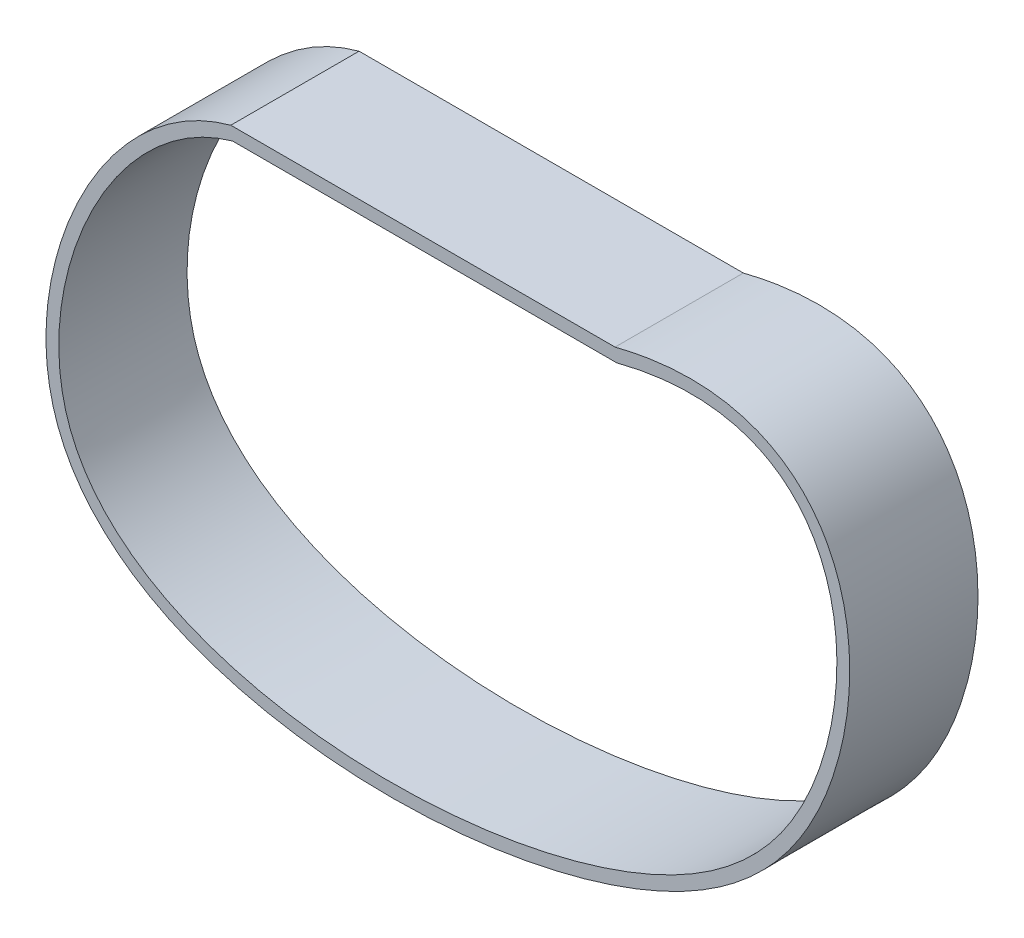
ISO-10303-21;
HEADER;
FILE_DESCRIPTION(('STEP AP214'),'2;1');
FILE_NAME('part.step','',(''),(''),'','','');
FILE_SCHEMA(('AUTOMOTIVE_DESIGN { 1 0 10303 214 1 1 1 1 }'));
ENDSEC;
DATA;
#1=APPLICATION_CONTEXT('core data for automotive mechanical design processes');
#2=APPLICATION_PROTOCOL_DEFINITION('international standard','automotive_design',2000,#1);
#3=PRODUCT_CONTEXT('',#1,'mechanical');
#4=PRODUCT('Part','Part','',(#3));
#5=PRODUCT_RELATED_PRODUCT_CATEGORY('part','',(#4));
#6=PRODUCT_DEFINITION_FORMATION('','',#4);
#7=PRODUCT_DEFINITION_CONTEXT('part definition',#1,'design');
#8=PRODUCT_DEFINITION('design','',#6,#7);
#9=PRODUCT_DEFINITION_SHAPE('','',#8);
#10=(LENGTH_UNIT() NAMED_UNIT(*) SI_UNIT(.MILLI.,.METRE.));
#11=(NAMED_UNIT(*) PLANE_ANGLE_UNIT() SI_UNIT($,.RADIAN.));
#12=(NAMED_UNIT(*) SI_UNIT($,.STERADIAN.) SOLID_ANGLE_UNIT());
#13=UNCERTAINTY_MEASURE_WITH_UNIT(LENGTH_MEASURE(1.E-05),#10,'distance_accuracy_value','');
#14=(GEOMETRIC_REPRESENTATION_CONTEXT(3) GLOBAL_UNCERTAINTY_ASSIGNED_CONTEXT((#13)) GLOBAL_UNIT_ASSIGNED_CONTEXT((#10,
#11,#12)) REPRESENTATION_CONTEXT('',''));
#15=CARTESIAN_POINT('',(0.,0.,0.));
#16=DIRECTION('',(0.,0.,1.));
#17=DIRECTION('',(1.,0.,0.));
#18=AXIS2_PLACEMENT_3D('',#15,#16,#17);
#19=CARTESIAN_POINT('',(7.04176794798978,-75.7034672830424,10.));
#20=DIRECTION('',(0.,0.,1.));
#21=DIRECTION('',(1.,0.,0.));
#22=AXIS2_PLACEMENT_3D('',#19,#20,#21);
#23=PLANE('',#22);
#24=CARTESIAN_POINT('',(-29.1094889381039,2.,10.));
#25=CARTESIAN_POINT('',(-29.2711666058595,1.9549326911528,10.));
#26=CARTESIAN_POINT('',(-29.5884364179434,1.86739098593829,10.));
#27=CARTESIAN_POINT('',(-30.2695314803509,1.6639563012079,10.));
#28=CARTESIAN_POINT('',(-31.4262311370426,1.28138083290379,10.));
#29=CARTESIAN_POINT('',(-33.7085773620182,0.380367449981853,10.));
#30=CARTESIAN_POINT('',(-38.0592019083928,-1.90982717441847,10.));
#31=CARTESIAN_POINT('',(-45.8904529427792,-8.21343610271494,10.));
#32=CARTESIAN_POINT('',(-52.6174472990949,-18.3270178560385,10.));
#33=CARTESIAN_POINT('',(-56.6236890520603,-29.5702665896402,10.));
#34=CARTESIAN_POINT('',(-58.101014880325,-38.1472034200514,10.));
#35=CARTESIAN_POINT('',(-57.8848929333308,-46.4553824854731,10.));
#36=CARTESIAN_POINT('',(-55.6832624950651,-54.0634661457601,10.));
#37=CARTESIAN_POINT('',(-51.496493039097,-60.4689673944458,10.));
#38=CARTESIAN_POINT('',(-43.8079720882923,-67.4320437479037,10.));
#39=CARTESIAN_POINT('',(-31.0172297044914,-73.3299705086028,10.));
#40=CARTESIAN_POINT('',(-12.5712535388374,-76.531233105732,10.));
#41=CARTESIAN_POINT('',(7.14083142473348,-76.2381425853265,10.));
#42=CARTESIAN_POINT('',(23.0722515106572,-73.3205239735684,10.));
#43=CARTESIAN_POINT('',(34.5691892012262,-69.5137189143569,10.));
#44=CARTESIAN_POINT('',(42.3972992010869,-65.8979102287756,10.));
#45=CARTESIAN_POINT('',(49.3729385138688,-61.3851431325316,10.));
#46=CARTESIAN_POINT('',(55.3956407749545,-55.8640534739069,10.));
#47=CARTESIAN_POINT('',(60.3600624453533,-49.2464626961319,10.));
#48=CARTESIAN_POINT('',(64.1625243454797,-41.4488946063427,10.));
#49=CARTESIAN_POINT('',(66.6524342232584,-32.9502772539975,10.));
#50=CARTESIAN_POINT('',(67.6683439176188,-24.2382306175426,10.));
#51=CARTESIAN_POINT('',(67.0127506533382,-15.7897180697165,10.));
#52=CARTESIAN_POINT('',(64.4422975211589,-8.0867291551945,10.));
#53=CARTESIAN_POINT('',(60.4443345047106,-2.76390479899914,10.));
#54=CARTESIAN_POINT('',(56.0440354852006,0.455274825771143,10.));
#55=CARTESIAN_POINT('',(52.1573597719881,2.25628821612541,10.));
#56=CARTESIAN_POINT('',(47.700836796645,3.37394475818058,10.));
#57=CARTESIAN_POINT('',(43.519128896257,3.69373851539056,10.));
#58=CARTESIAN_POINT('',(39.8875333080928,3.56063997570251,10.));
#59=CARTESIAN_POINT('',(37.01944760836,3.26100487102238,10.));
#60=CARTESIAN_POINT('',(34.5020235457053,2.83865803088808,10.));
#61=CARTESIAN_POINT('',(32.4202856585923,2.39664087013776,10.));
#62=CARTESIAN_POINT('',(31.3390053913286,2.13589874043388,10.));
#63=CARTESIAN_POINT('',(30.8060193736147,2.,10.));
#64=B_SPLINE_CURVE_WITH_KNOTS('',3,(#24,#25,#26,#27,#28,#29,#30,#31,#32,#33,#34,#35,#36,#37,#38,
#39,#40,#41,#42,#43,#44,#45,#46,#47,#48,#49,#50,#51,#52,#53,#54,#55,#56,#57,#58,#59,#60,#61,#62,
#63),.UNSPECIFIED.,.F.,.F.,(4,1,1,1,1,1,1,1,1,1,1,1,1,1,1,1,1,1,1,1,1,1,1,1,1,1,1,1,1,1,1,1,1,1,
1,1,1,4),(0.000597944691064563,0.00255204829505629,0.00450615189904802,0.00841435910703148,
0.0162307735229985,0.0318636023549325,0.0631292600188003,0.125660575346536,0.156926233010404,
0.188191890674272,0.219457548338139,0.250723206002007,0.281988863665875,0.313254521329743,
0.375785836657479,0.438317151985215,0.50084846731295,0.563379782640686,0.594645440304554,
0.625911097968422,0.65717675563229,0.688442413296158,0.719708070960025,0.750973728623893,
0.782239386287761,0.813505043951629,0.844770701615497,0.876036359279365,0.907302016943233,
0.922934845775166,0.9385676746071,0.954200503439034,0.969833332270968,0.977649746686935,
0.985466161102902,0.993282575518869,0.997190782726853,1.00109898993484),.UNSPECIFIED.);
#65=CARTESIAN_POINT('',(-29.1094889381039,2.,10.));
#66=VERTEX_POINT('',#65);
#67=CARTESIAN_POINT('',(30.8060193736147,2.,10.));
#68=VERTEX_POINT('',#67);
#69=EDGE_CURVE('E118',#66,#68,#64,.T.);
#70=ORIENTED_EDGE('',*,*,#69,.T.);
#71=DIRECTION('',(-1.,0.,0.));
#72=VECTOR('',#71,1.);
#73=CARTESIAN_POINT('',(-29.1094889381039,2.,10.));
#74=LINE('',#73,#72);
#75=EDGE_CURVE('E122',#68,#66,#74,.T.);
#76=ORIENTED_EDGE('',*,*,#75,.T.);
#77=EDGE_LOOP('',(#70,#76));
#78=FACE_BOUND('',#77,.T.);
#79=DIRECTION('',(-1.,0.,0.));
#80=VECTOR('',#79,1.);
#81=CARTESIAN_POINT('',(-28.8359550805237,0.,10.));
#82=LINE('',#81,#80);
#83=CARTESIAN_POINT('',(31.0589792051905,0.,10.));
#84=VERTEX_POINT('',#83);
#85=CARTESIAN_POINT('',(-28.8359550805237,0.,10.));
#86=VERTEX_POINT('',#85);
#87=EDGE_CURVE('E74',#84,#86,#82,.T.);
#88=ORIENTED_EDGE('',*,*,#87,.F.);
#89=CARTESIAN_POINT('',(-28.8359550805237,0.,10.));
#90=CARTESIAN_POINT('',(-47.7084642048188,-5.26067210909981,10.));
#91=CARTESIAN_POINT('',(-78.4238630547212,-73.4294227613478,10.));
#92=CARTESIAN_POINT('',(19.3538091058708,-80.6919886023268,10.));
#93=CARTESIAN_POINT('',(72.2254747069718,-44.3020234312468,10.));
#94=CARTESIAN_POINT('',(68.4954839154176,9.70336515848219,10.));
#95=CARTESIAN_POINT('',(31.0589792051905,0.,10.));
#96=B_SPLINE_CURVE_WITH_KNOTS('',3,(#89,#90,#91,#92,#93,#94,#95),.UNSPECIFIED.,.F.,.F.,(4,1,1,1,
4),(0.,0.236147059818953,0.582786677606789,0.722119225745826,1.),.UNSPECIFIED.);
#97=EDGE_CURVE('E80',#86,#84,#96,.T.);
#98=ORIENTED_EDGE('',*,*,#97,.F.);
#99=EDGE_LOOP('',(#88,#98));
#100=FACE_BOUND('',#99,.T.);
#101=ADVANCED_FACE('F33',(#78,#100),#23,.T.);
#102=CARTESIAN_POINT('',(7.04176794798978,-75.7034672830424,-10.));
#103=DIRECTION('',(0.,0.,1.));
#104=DIRECTION('',(1.,0.,0.));
#105=AXIS2_PLACEMENT_3D('',#102,#103,#104);
#106=PLANE('',#105);
#107=CARTESIAN_POINT('',(-29.1094889381039,2.,-10.));
#108=CARTESIAN_POINT('',(-29.2711666058595,1.9549326911528,-10.));
#109=CARTESIAN_POINT('',(-29.5884364179434,1.86739098593829,-10.));
#110=CARTESIAN_POINT('',(-30.2695314803509,1.6639563012079,-10.));
#111=CARTESIAN_POINT('',(-31.4262311370426,1.28138083290379,-10.));
#112=CARTESIAN_POINT('',(-33.7085773620182,0.380367449981853,-10.));
#113=CARTESIAN_POINT('',(-38.0592019083928,-1.90982717441847,-10.));
#114=CARTESIAN_POINT('',(-45.8904529427792,-8.21343610271494,-10.));
#115=CARTESIAN_POINT('',(-52.6174472990949,-18.3270178560385,-10.));
#116=CARTESIAN_POINT('',(-56.6236890520603,-29.5702665896402,-10.));
#117=CARTESIAN_POINT('',(-58.101014880325,-38.1472034200514,-10.));
#118=CARTESIAN_POINT('',(-57.8848929333308,-46.4553824854731,-10.));
#119=CARTESIAN_POINT('',(-55.6832624950651,-54.0634661457601,-10.));
#120=CARTESIAN_POINT('',(-51.496493039097,-60.4689673944458,-10.));
#121=CARTESIAN_POINT('',(-43.8079720882923,-67.4320437479037,-10.));
#122=CARTESIAN_POINT('',(-31.0172297044914,-73.3299705086028,-10.));
#123=CARTESIAN_POINT('',(-12.5712535388374,-76.531233105732,-10.));
#124=CARTESIAN_POINT('',(7.14083142473348,-76.2381425853265,-10.));
#125=CARTESIAN_POINT('',(23.0722515106572,-73.3205239735684,-10.));
#126=CARTESIAN_POINT('',(34.5691892012262,-69.5137189143569,-10.));
#127=CARTESIAN_POINT('',(42.3972992010869,-65.8979102287756,-10.));
#128=CARTESIAN_POINT('',(49.3729385138688,-61.3851431325316,-10.));
#129=CARTESIAN_POINT('',(55.3956407749545,-55.8640534739069,-10.));
#130=CARTESIAN_POINT('',(60.3600624453533,-49.2464626961319,-10.));
#131=CARTESIAN_POINT('',(64.1625243454797,-41.4488946063427,-10.));
#132=CARTESIAN_POINT('',(66.6524342232584,-32.9502772539975,-10.));
#133=CARTESIAN_POINT('',(67.6683439176188,-24.2382306175426,-10.));
#134=CARTESIAN_POINT('',(67.0127506533382,-15.7897180697165,-10.));
#135=CARTESIAN_POINT('',(64.4422975211589,-8.0867291551945,-10.));
#136=CARTESIAN_POINT('',(60.4443345047106,-2.76390479899914,-10.));
#137=CARTESIAN_POINT('',(56.0440354852006,0.455274825771143,-10.));
#138=CARTESIAN_POINT('',(52.1573597719881,2.25628821612541,-10.));
#139=CARTESIAN_POINT('',(47.700836796645,3.37394475818058,-10.));
#140=CARTESIAN_POINT('',(43.519128896257,3.69373851539056,-10.));
#141=CARTESIAN_POINT('',(39.8875333080928,3.56063997570251,-10.));
#142=CARTESIAN_POINT('',(37.01944760836,3.26100487102238,-10.));
#143=CARTESIAN_POINT('',(34.5020235457053,2.83865803088808,-10.));
#144=CARTESIAN_POINT('',(32.4202856585923,2.39664087013776,-10.));
#145=CARTESIAN_POINT('',(31.3390053913286,2.13589874043388,-10.));
#146=CARTESIAN_POINT('',(30.8060193736147,2.,-10.));
#147=B_SPLINE_CURVE_WITH_KNOTS('',3,(#107,#108,#109,#110,#111,#112,#113,#114,#115,#116,#117,
#118,#119,#120,#121,#122,#123,#124,#125,#126,#127,#128,#129,#130,#131,#132,#133,#134,#135,#136,
#137,#138,#139,#140,#141,#142,#143,#144,#145,#146),.UNSPECIFIED.,.F.,.F.,(4,1,1,1,1,1,1,1,1,1,1,
1,1,1,1,1,1,1,1,1,1,1,1,1,1,1,1,1,1,1,1,1,1,1,1,1,1,4),(0.000597944691064563,
0.00255204829505629,0.00450615189904802,0.00841435910703148,0.0162307735229985,
0.0318636023549325,0.0631292600188003,0.125660575346536,0.156926233010404,0.188191890674272,
0.219457548338139,0.250723206002007,0.281988863665875,0.313254521329743,0.375785836657479,
0.438317151985215,0.50084846731295,0.563379782640686,0.594645440304554,0.625911097968422,
0.65717675563229,0.688442413296158,0.719708070960025,0.750973728623893,0.782239386287761,
0.813505043951629,0.844770701615497,0.876036359279365,0.907302016943233,0.922934845775166,
0.9385676746071,0.954200503439034,0.969833332270968,0.977649746686935,0.985466161102902,
0.993282575518869,0.997190782726853,1.00109898993484),.UNSPECIFIED.);
#148=CARTESIAN_POINT('',(-29.1094889381039,2.,-10.));
#149=VERTEX_POINT('',#148);
#150=CARTESIAN_POINT('',(30.8060193736147,2.,-10.));
#151=VERTEX_POINT('',#150);
#152=EDGE_CURVE('E119',#149,#151,#147,.T.);
#153=ORIENTED_EDGE('',*,*,#152,.F.);
#154=DIRECTION('',(-1.,0.,0.));
#155=VECTOR('',#154,1.);
#156=CARTESIAN_POINT('',(-29.1094889381039,2.,-10.));
#157=LINE('',#156,#155);
#158=EDGE_CURVE('E112',#151,#149,#157,.T.);
#159=ORIENTED_EDGE('',*,*,#158,.F.);
#160=EDGE_LOOP('',(#153,#159));
#161=FACE_BOUND('',#160,.T.);
#162=CARTESIAN_POINT('',(-28.8359550805237,0.,-10.));
#163=CARTESIAN_POINT('',(-47.7084642048188,-5.26067210909981,-10.));
#164=CARTESIAN_POINT('',(-78.4238630547212,-73.4294227613478,-10.));
#165=CARTESIAN_POINT('',(19.3538091058708,-80.6919886023268,-10.));
#166=CARTESIAN_POINT('',(72.2254747069718,-44.3020234312468,-10.));
#167=CARTESIAN_POINT('',(68.4954839154176,9.70336515848219,-10.));
#168=CARTESIAN_POINT('',(31.0589792051905,0.,-10.));
#169=B_SPLINE_CURVE_WITH_KNOTS('',3,(#162,#163,#164,#165,#166,#167,#168),.UNSPECIFIED.,.F.,.F.,
(4,1,1,1,4),(0.,0.236147059818953,0.582786677606789,0.722119225745826,1.),.UNSPECIFIED.);
#170=CARTESIAN_POINT('',(-28.8359550805237,0.,-10.));
#171=VERTEX_POINT('',#170);
#172=CARTESIAN_POINT('',(31.0589792051905,0.,-10.));
#173=VERTEX_POINT('',#172);
#174=EDGE_CURVE('E56',#171,#173,#169,.T.);
#175=ORIENTED_EDGE('',*,*,#174,.T.);
#176=DIRECTION('',(-1.,0.,0.));
#177=VECTOR('',#176,1.);
#178=CARTESIAN_POINT('',(-28.8359550805237,0.,-10.));
#179=LINE('',#178,#177);
#180=EDGE_CURVE('E84',#173,#171,#179,.T.);
#181=ORIENTED_EDGE('',*,*,#180,.T.);
#182=EDGE_LOOP('',(#175,#181));
#183=FACE_BOUND('',#182,.T.);
#184=ADVANCED_FACE('F101',(#161,#183),#106,.F.);
#185=DIRECTION('',(0.,0.,-1.));
#186=VECTOR('',#185,1.);
#187=SURFACE_OF_LINEAR_EXTRUSION('',#64,#186);
#188=ORIENTED_EDGE('',*,*,#152,.T.);
#189=DIRECTION('',(0.,0.,-1.));
#190=VECTOR('',#189,1.);
#191=CARTESIAN_POINT('',(30.8060193736147,2.,10.));
#192=LINE('',#191,#190);
#193=EDGE_CURVE('E11',#68,#151,#192,.T.);
#194=ORIENTED_EDGE('',*,*,#193,.F.);
#195=ORIENTED_EDGE('',*,*,#69,.F.);
#196=DIRECTION('',(0.,0.,-1.));
#197=VECTOR('',#196,1.);
#198=CARTESIAN_POINT('',(-29.1094889381039,2.,10.));
#199=LINE('',#198,#197);
#200=EDGE_CURVE('E42',#66,#149,#199,.T.);
#201=ORIENTED_EDGE('',*,*,#200,.T.);
#202=EDGE_LOOP('',(#188,#194,#195,#201));
#203=FACE_BOUND('',#202,.T.);
#204=ADVANCED_FACE('F35',(#203),#187,.F.);
#205=CARTESIAN_POINT('',(-29.1094889381039,2.,10.));
#206=DIRECTION('',(0.,-1.,0.));
#207=DIRECTION('',(1.,0.,0.));
#208=AXIS2_PLACEMENT_3D('',#205,#206,#207);
#209=PLANE('',#208);
#210=ORIENTED_EDGE('',*,*,#158,.T.);
#211=ORIENTED_EDGE('',*,*,#200,.F.);
#212=ORIENTED_EDGE('',*,*,#75,.F.);
#213=ORIENTED_EDGE('',*,*,#193,.T.);
#214=EDGE_LOOP('',(#210,#211,#212,#213));
#215=FACE_BOUND('',#214,.T.);
#216=ADVANCED_FACE('F98',(#215),#209,.F.);
#217=DIRECTION('',(0.,0.,-1.));
#218=VECTOR('',#217,1.);
#219=SURFACE_OF_LINEAR_EXTRUSION('',#96,#218);
#220=ORIENTED_EDGE('',*,*,#174,.F.);
#221=DIRECTION('',(0.,0.,-1.));
#222=VECTOR('',#221,1.);
#223=CARTESIAN_POINT('',(-28.8359550805237,0.,10.));
#224=LINE('',#223,#222);
#225=EDGE_CURVE('E76',#86,#171,#224,.T.);
#226=ORIENTED_EDGE('',*,*,#225,.F.);
#227=ORIENTED_EDGE('',*,*,#97,.T.);
#228=DIRECTION('',(0.,0.,-1.));
#229=VECTOR('',#228,1.);
#230=CARTESIAN_POINT('',(31.0589792051905,0.,10.));
#231=LINE('',#230,#229);
#232=EDGE_CURVE('E49',#84,#173,#231,.T.);
#233=ORIENTED_EDGE('',*,*,#232,.T.);
#234=EDGE_LOOP('',(#220,#226,#227,#233));
#235=FACE_BOUND('',#234,.T.);
#236=ADVANCED_FACE('F82',(#235),#219,.T.);
#237=CARTESIAN_POINT('',(-28.8359550805237,0.,10.));
#238=DIRECTION('',(0.,-1.,0.));
#239=DIRECTION('',(0.,0.,-1.));
#240=AXIS2_PLACEMENT_3D('',#237,#238,#239);
#241=PLANE('',#240);
#242=ORIENTED_EDGE('',*,*,#180,.F.);
#243=ORIENTED_EDGE('',*,*,#232,.F.);
#244=ORIENTED_EDGE('',*,*,#87,.T.);
#245=ORIENTED_EDGE('',*,*,#225,.T.);
#246=EDGE_LOOP('',(#242,#243,#244,#245));
#247=FACE_BOUND('',#246,.T.);
#248=ADVANCED_FACE('F75',(#247),#241,.T.);
#249=CLOSED_SHELL('',(#101,#184,#204,#216,#236,#248));
#250=MANIFOLD_SOLID_BREP('B2',#249);
#251=ADVANCED_BREP_SHAPE_REPRESENTATION('',(#18,#250),#14);
#252=SHAPE_DEFINITION_REPRESENTATION(#9,#251);
ENDSEC;
END-ISO-10303-21;
